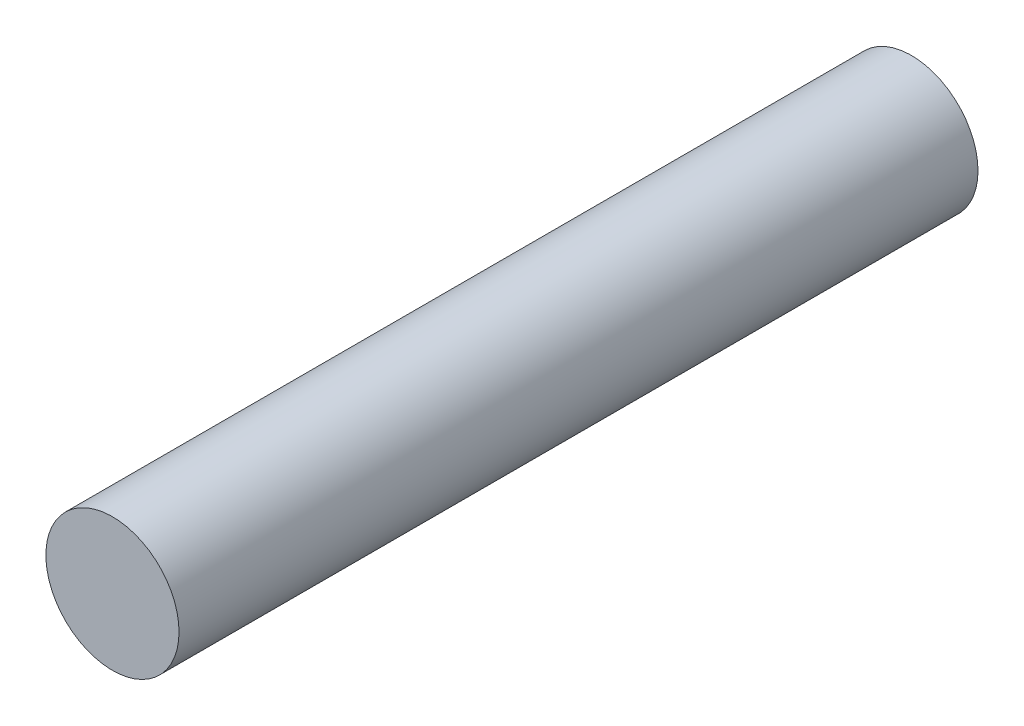
ISO-10303-21;
HEADER;
FILE_DESCRIPTION(('STEP AP214'),'2;1');
FILE_NAME('part.step','',(''),(''),'','','');
FILE_SCHEMA(('AUTOMOTIVE_DESIGN { 1 0 10303 214 1 1 1 1 }'));
ENDSEC;
DATA;
#1=APPLICATION_CONTEXT('core data for automotive mechanical design processes');
#2=APPLICATION_PROTOCOL_DEFINITION('international standard','automotive_design',2000,#1);
#3=PRODUCT_CONTEXT('',#1,'mechanical');
#4=PRODUCT('Part','Part','',(#3));
#5=PRODUCT_RELATED_PRODUCT_CATEGORY('part','',(#4));
#6=PRODUCT_DEFINITION_FORMATION('','',#4);
#7=PRODUCT_DEFINITION_CONTEXT('part definition',#1,'design');
#8=PRODUCT_DEFINITION('design','',#6,#7);
#9=PRODUCT_DEFINITION_SHAPE('','',#8);
#10=(LENGTH_UNIT() NAMED_UNIT(*) SI_UNIT(.MILLI.,.METRE.));
#11=(NAMED_UNIT(*) PLANE_ANGLE_UNIT() SI_UNIT($,.RADIAN.));
#12=(NAMED_UNIT(*) SI_UNIT($,.STERADIAN.) SOLID_ANGLE_UNIT());
#13=UNCERTAINTY_MEASURE_WITH_UNIT(LENGTH_MEASURE(1.E-05),#10,'distance_accuracy_value','');
#14=(GEOMETRIC_REPRESENTATION_CONTEXT(3) GLOBAL_UNCERTAINTY_ASSIGNED_CONTEXT((#13)) GLOBAL_UNIT_ASSIGNED_CONTEXT((#10,
#11,#12)) REPRESENTATION_CONTEXT('',''));
#15=CARTESIAN_POINT('',(0.,0.,0.));
#16=DIRECTION('',(0.,0.,1.));
#17=DIRECTION('',(1.,0.,0.));
#18=AXIS2_PLACEMENT_3D('',#15,#16,#17);
#19=CARTESIAN_POINT('',(0.,0.,30.));
#20=DIRECTION('',(0.,0.,-1.));
#21=DIRECTION('',(-1.,0.,0.));
#22=AXIS2_PLACEMENT_3D('',#19,#20,#21);
#23=CYLINDRICAL_SURFACE('',#22,2.5);
#24=CARTESIAN_POINT('',(0.,0.,30.));
#25=DIRECTION('',(0.,0.,1.));
#26=DIRECTION('',(1.,0.,0.));
#27=AXIS2_PLACEMENT_3D('',#24,#25,#26);
#28=CIRCLE('',#27,2.5);
#29=CARTESIAN_POINT('',(2.5,0.,30.));
#30=VERTEX_POINT('',#29);
#31=EDGE_CURVE('E10',#30,#30,#28,.T.);
#32=ORIENTED_EDGE('',*,*,#31,.F.);
#33=EDGE_LOOP('',(#32));
#34=FACE_BOUND('',#33,.T.);
#35=CARTESIAN_POINT('',(0.,0.,0.));
#36=DIRECTION('',(0.,0.,1.));
#37=DIRECTION('',(1.,0.,0.));
#38=AXIS2_PLACEMENT_3D('',#35,#36,#37);
#39=CIRCLE('',#38,2.5);
#40=CARTESIAN_POINT('',(2.5,0.,0.));
#41=VERTEX_POINT('',#40);
#42=EDGE_CURVE('E46',#41,#41,#39,.T.);
#43=ORIENTED_EDGE('',*,*,#42,.T.);
#44=EDGE_LOOP('',(#43));
#45=FACE_BOUND('',#44,.T.);
#46=ADVANCED_FACE('F43',(#34,#45),#23,.T.);
#47=CARTESIAN_POINT('',(0.,0.,30.));
#48=DIRECTION('',(0.,0.,1.));
#49=DIRECTION('',(1.,0.,0.));
#50=AXIS2_PLACEMENT_3D('',#47,#48,#49);
#51=PLANE('',#50);
#52=ORIENTED_EDGE('',*,*,#31,.T.);
#53=EDGE_LOOP('',(#52));
#54=FACE_BOUND('',#53,.T.);
#55=ADVANCED_FACE('F60',(#54),#51,.T.);
#56=CARTESIAN_POINT('',(0.,0.,0.));
#57=DIRECTION('',(0.,0.,1.));
#58=DIRECTION('',(1.,0.,0.));
#59=AXIS2_PLACEMENT_3D('',#56,#57,#58);
#60=PLANE('',#59);
#61=ORIENTED_EDGE('',*,*,#42,.F.);
#62=EDGE_LOOP('',(#61));
#63=FACE_BOUND('',#62,.T.);
#64=ADVANCED_FACE('F58',(#63),#60,.F.);
#65=CLOSED_SHELL('',(#46,#55,#64));
#66=MANIFOLD_SOLID_BREP('B2',#65);
#67=ADVANCED_BREP_SHAPE_REPRESENTATION('',(#18,#66),#14);
#68=SHAPE_DEFINITION_REPRESENTATION(#9,#67);
ENDSEC;
END-ISO-10303-21;
